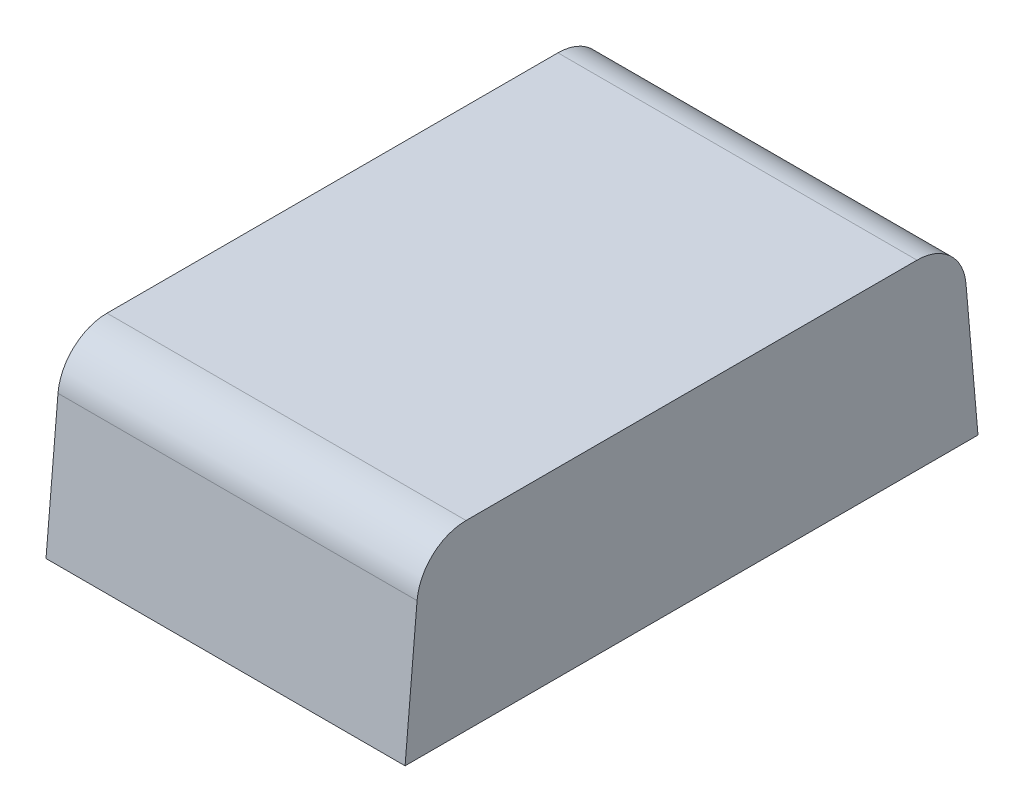
ISO-10303-21;
HEADER;
FILE_DESCRIPTION(('STEP AP214'),'2;1');
FILE_NAME('part.step','',(''),(''),'','','');
FILE_SCHEMA(('AUTOMOTIVE_DESIGN { 1 0 10303 214 1 1 1 1 }'));
ENDSEC;
DATA;
#1=APPLICATION_CONTEXT('core data for automotive mechanical design processes');
#2=APPLICATION_PROTOCOL_DEFINITION('international standard','automotive_design',2000,#1);
#3=PRODUCT_CONTEXT('',#1,'mechanical');
#4=PRODUCT('Part','Part','',(#3));
#5=PRODUCT_RELATED_PRODUCT_CATEGORY('part','',(#4));
#6=PRODUCT_DEFINITION_FORMATION('','',#4);
#7=PRODUCT_DEFINITION_CONTEXT('part definition',#1,'design');
#8=PRODUCT_DEFINITION('design','',#6,#7);
#9=PRODUCT_DEFINITION_SHAPE('','',#8);
#10=(LENGTH_UNIT() NAMED_UNIT(*) SI_UNIT(.MILLI.,.METRE.));
#11=(NAMED_UNIT(*) PLANE_ANGLE_UNIT() SI_UNIT($,.RADIAN.));
#12=(NAMED_UNIT(*) SI_UNIT($,.STERADIAN.) SOLID_ANGLE_UNIT());
#13=UNCERTAINTY_MEASURE_WITH_UNIT(LENGTH_MEASURE(1.E-05),#10,'distance_accuracy_value','');
#14=(GEOMETRIC_REPRESENTATION_CONTEXT(3) GLOBAL_UNCERTAINTY_ASSIGNED_CONTEXT((#13)) GLOBAL_UNIT_ASSIGNED_CONTEXT((#10,
#11,#12)) REPRESENTATION_CONTEXT('',''));
#15=CARTESIAN_POINT('',(0.,0.,0.));
#16=DIRECTION('',(0.,0.,1.));
#17=DIRECTION('',(1.,0.,0.));
#18=AXIS2_PLACEMENT_3D('',#15,#16,#17);
#19=CARTESIAN_POINT('',(0.505,1.3,-31.0166331174));
#20=DIRECTION('',(1.,0.,0.));
#21=DIRECTION('',(0.,0.,-1.));
#22=AXIS2_PLACEMENT_3D('',#19,#20,#21);
#23=CYLINDRICAL_SURFACE('',#22,0.0999999999999998);
#24=CARTESIAN_POINT('',(0.505,1.3,-31.0166331174));
#25=DIRECTION('',(1.,0.,0.));
#26=DIRECTION('',(0.,0.,-1.));
#27=AXIS2_PLACEMENT_3D('',#24,#25,#26);
#28=CIRCLE('',#27,0.0999999999999998);
#29=CARTESIAN_POINT('',(0.505,1.30871557427365,-30.9170136475899));
#30=VERTEX_POINT('',#29);
#31=CARTESIAN_POINT('',(0.505,1.4,-31.0166331174));
#32=VERTEX_POINT('',#31);
#33=EDGE_CURVE('E21',#30,#32,#28,.F.);
#34=ORIENTED_EDGE('',*,*,#33,.F.);
#35=DIRECTION('',(-1.,0.,0.));
#36=VECTOR('',#35,1.);
#37=CARTESIAN_POINT('',(0.87,1.308715574275,-30.91701364759));
#38=LINE('',#37,#36);
#39=CARTESIAN_POINT('',(1.235,1.30871557427458,-30.9170136475934));
#40=VERTEX_POINT('',#39);
#41=EDGE_CURVE('E61',#40,#30,#38,.T.);
#42=ORIENTED_EDGE('',*,*,#41,.F.);
#43=CARTESIAN_POINT('',(1.235,1.3,-31.0166331174));
#44=DIRECTION('',(1.,0.,0.));
#45=DIRECTION('',(0.,0.,-1.));
#46=AXIS2_PLACEMENT_3D('',#43,#44,#45);
#47=CIRCLE('',#46,0.0999999999999998);
#48=CARTESIAN_POINT('',(1.235,1.4,-31.0166331174));
#49=VERTEX_POINT('',#48);
#50=EDGE_CURVE('E84',#49,#40,#47,.T.);
#51=ORIENTED_EDGE('',*,*,#50,.F.);
#52=DIRECTION('',(1.,0.,0.));
#53=VECTOR('',#52,1.);
#54=CARTESIAN_POINT('',(0.87,1.4,-31.0166331174));
#55=LINE('',#54,#53);
#56=EDGE_CURVE('E74',#32,#49,#55,.T.);
#57=ORIENTED_EDGE('',*,*,#56,.F.);
#58=EDGE_LOOP('',(#34,#42,#51,#57));
#59=FACE_BOUND('',#58,.T.);
#60=ADVANCED_FACE('F17',(#59),#23,.T.);
#61=CARTESIAN_POINT('',(1.235,1.3,-31.9333668826));
#62=DIRECTION('',(-1.,0.,0.));
#63=DIRECTION('',(0.,0.,1.));
#64=AXIS2_PLACEMENT_3D('',#61,#62,#63);
#65=CYLINDRICAL_SURFACE('',#64,0.0999999999999998);
#66=CARTESIAN_POINT('',(1.235,1.3,-31.9333668826));
#67=DIRECTION('',(-1.,0.,0.));
#68=DIRECTION('',(0.,0.,1.));
#69=AXIS2_PLACEMENT_3D('',#66,#67,#68);
#70=CIRCLE('',#69,0.0999999999999998);
#71=CARTESIAN_POINT('',(1.235,1.30871557427469,-32.0329863524061));
#72=VERTEX_POINT('',#71);
#73=CARTESIAN_POINT('',(1.235,1.4,-31.9333668826));
#74=VERTEX_POINT('',#73);
#75=EDGE_CURVE('E97',#72,#74,#70,.F.);
#76=ORIENTED_EDGE('',*,*,#75,.F.);
#77=DIRECTION('',(1.,0.,0.));
#78=VECTOR('',#77,1.);
#79=CARTESIAN_POINT('',(0.87,1.308715574275,-32.03298635241));
#80=LINE('',#79,#78);
#81=CARTESIAN_POINT('',(0.505,1.30871557427458,-32.0329863524065));
#82=VERTEX_POINT('',#81);
#83=EDGE_CURVE('E79',#82,#72,#80,.T.);
#84=ORIENTED_EDGE('',*,*,#83,.F.);
#85=CARTESIAN_POINT('',(0.505,1.3,-31.9333668826));
#86=DIRECTION('',(-1.,0.,0.));
#87=DIRECTION('',(0.,0.,1.));
#88=AXIS2_PLACEMENT_3D('',#85,#86,#87);
#89=CIRCLE('',#88,0.0999999999999998);
#90=CARTESIAN_POINT('',(0.505,1.4,-31.9333668826));
#91=VERTEX_POINT('',#90);
#92=EDGE_CURVE('E105',#91,#82,#89,.T.);
#93=ORIENTED_EDGE('',*,*,#92,.F.);
#94=DIRECTION('',(-1.,0.,0.));
#95=VECTOR('',#94,1.);
#96=CARTESIAN_POINT('',(0.87,1.4,-31.9333668826));
#97=LINE('',#96,#95);
#98=EDGE_CURVE('E111',#74,#91,#97,.T.);
#99=ORIENTED_EDGE('',*,*,#98,.F.);
#100=EDGE_LOOP('',(#76,#84,#93,#99));
#101=FACE_BOUND('',#100,.T.);
#102=ADVANCED_FACE('F130',(#101),#65,.T.);
#103=CARTESIAN_POINT('',(1.235,1.4,-31.9333668826));
#104=DIRECTION('',(0.,1.,0.));
#105=DIRECTION('',(-1.,0.,0.));
#106=AXIS2_PLACEMENT_3D('',#103,#104,#105);
#107=PLANE('',#106);
#108=ORIENTED_EDGE('',*,*,#98,.T.);
#109=DIRECTION('',(0.,0.,-1.));
#110=VECTOR('',#109,1.);
#111=CARTESIAN_POINT('',(0.505,1.4,-31.475));
#112=LINE('',#111,#110);
#113=EDGE_CURVE('E78',#32,#91,#112,.T.);
#114=ORIENTED_EDGE('',*,*,#113,.F.);
#115=ORIENTED_EDGE('',*,*,#56,.T.);
#116=DIRECTION('',(0.,0.,1.));
#117=VECTOR('',#116,1.);
#118=CARTESIAN_POINT('',(1.235,1.4,-31.475));
#119=LINE('',#118,#117);
#120=EDGE_CURVE('E100',#74,#49,#119,.T.);
#121=ORIENTED_EDGE('',*,*,#120,.F.);
#122=EDGE_LOOP('',(#108,#114,#115,#121));
#123=FACE_BOUND('',#122,.T.);
#124=ADVANCED_FACE('F133',(#123),#107,.T.);
#125=CARTESIAN_POINT('',(1.235,1.03,-32.0573708055));
#126=DIRECTION('',(0.,0.0871557427222329,-0.99619469809397));
#127=DIRECTION('',(-1.,0.,0.));
#128=AXIS2_PLACEMENT_3D('',#125,#126,#127);
#129=PLANE('',#128);
#130=DIRECTION('',(-1.,0.,0.));
#131=VECTOR('',#130,1.);
#132=CARTESIAN_POINT('',(0.87,1.03,-32.0573708055));
#133=LINE('',#132,#131);
#134=CARTESIAN_POINT('',(1.235,1.03,-32.0573708055));
#135=VERTEX_POINT('',#134);
#136=CARTESIAN_POINT('',(0.505,1.03,-32.0573708055));
#137=VERTEX_POINT('',#136);
#138=EDGE_CURVE('E94',#135,#137,#133,.T.);
#139=ORIENTED_EDGE('',*,*,#138,.T.);
#140=DIRECTION('',(0.,-0.996194698091809,-0.0871557427469325));
#141=VECTOR('',#140,1.);
#142=CARTESIAN_POINT('',(0.505,1.3087155742748,-32.0329863524031));
#143=LINE('',#142,#141);
#144=EDGE_CURVE('E70',#82,#137,#143,.T.);
#145=ORIENTED_EDGE('',*,*,#144,.F.);
#146=ORIENTED_EDGE('',*,*,#83,.T.);
#147=DIRECTION('',(0.,0.996194698091546,0.0871557427499353));
#148=VECTOR('',#147,1.);
#149=CARTESIAN_POINT('',(1.235,1.03,-32.0573708055));
#150=LINE('',#149,#148);
#151=EDGE_CURVE('E101',#135,#72,#150,.T.);
#152=ORIENTED_EDGE('',*,*,#151,.F.);
#153=EDGE_LOOP('',(#139,#145,#146,#152));
#154=FACE_BOUND('',#153,.T.);
#155=ADVANCED_FACE('F128',(#154),#129,.T.);
#156=CARTESIAN_POINT('',(0.505,1.03,-32.0573708055));
#157=DIRECTION('',(-1.,0.,0.));
#158=DIRECTION('',(0.,0.,1.));
#159=AXIS2_PLACEMENT_3D('',#156,#157,#158);
#160=PLANE('',#159);
#161=DIRECTION('',(0.,0.,1.));
#162=VECTOR('',#161,1.);
#163=CARTESIAN_POINT('',(0.505,1.03,-31.475));
#164=LINE('',#163,#162);
#165=CARTESIAN_POINT('',(0.505,1.03,-30.8926291945));
#166=VERTEX_POINT('',#165);
#167=EDGE_CURVE('E83',#137,#166,#164,.T.);
#168=ORIENTED_EDGE('',*,*,#167,.T.);
#169=DIRECTION('',(0.,-0.996194698093973,0.087155742722196));
#170=VECTOR('',#169,1.);
#171=CARTESIAN_POINT('',(0.505,1.1693577871375,-30.904821421045));
#172=LINE('',#171,#170);
#173=EDGE_CURVE('E66',#30,#166,#172,.T.);
#174=ORIENTED_EDGE('',*,*,#173,.F.);
#175=ORIENTED_EDGE('',*,*,#33,.T.);
#176=ORIENTED_EDGE('',*,*,#113,.T.);
#177=ORIENTED_EDGE('',*,*,#92,.T.);
#178=ORIENTED_EDGE('',*,*,#144,.T.);
#179=EDGE_LOOP('',(#168,#174,#175,#176,#177,#178));
#180=FACE_BOUND('',#179,.T.);
#181=ADVANCED_FACE('F81',(#180),#160,.T.);
#182=CARTESIAN_POINT('',(0.505,1.03,-30.8926291945));
#183=DIRECTION('',(0.,0.087155742722196,0.996194698093973));
#184=DIRECTION('',(1.,0.,0.));
#185=AXIS2_PLACEMENT_3D('',#182,#183,#184);
#186=PLANE('',#185);
#187=DIRECTION('',(1.,0.,0.));
#188=VECTOR('',#187,1.);
#189=CARTESIAN_POINT('',(0.87,1.03,-30.8926291945));
#190=LINE('',#189,#188);
#191=CARTESIAN_POINT('',(1.235,1.03,-30.8926291945));
#192=VERTEX_POINT('',#191);
#193=EDGE_CURVE('E27',#166,#192,#190,.T.);
#194=ORIENTED_EDGE('',*,*,#193,.T.);
#195=DIRECTION('',(0.,-0.996194698091809,0.0871557427469325));
#196=VECTOR('',#195,1.);
#197=CARTESIAN_POINT('',(1.235,1.3087155742748,-30.917013647597));
#198=LINE('',#197,#196);
#199=EDGE_CURVE('E35',#40,#192,#198,.T.);
#200=ORIENTED_EDGE('',*,*,#199,.F.);
#201=ORIENTED_EDGE('',*,*,#41,.T.);
#202=ORIENTED_EDGE('',*,*,#173,.T.);
#203=EDGE_LOOP('',(#194,#200,#201,#202));
#204=FACE_BOUND('',#203,.T.);
#205=ADVANCED_FACE('F64',(#204),#186,.T.);
#206=CARTESIAN_POINT('',(1.235,1.03,-30.8926291945));
#207=DIRECTION('',(1.,0.,0.));
#208=DIRECTION('',(0.,0.,-1.));
#209=AXIS2_PLACEMENT_3D('',#206,#207,#208);
#210=PLANE('',#209);
#211=ORIENTED_EDGE('',*,*,#75,.T.);
#212=ORIENTED_EDGE('',*,*,#120,.T.);
#213=ORIENTED_EDGE('',*,*,#50,.T.);
#214=ORIENTED_EDGE('',*,*,#199,.T.);
#215=DIRECTION('',(0.,0.,-1.));
#216=VECTOR('',#215,1.);
#217=CARTESIAN_POINT('',(1.235,1.03,-31.475));
#218=LINE('',#217,#216);
#219=EDGE_CURVE('E11',#192,#135,#218,.T.);
#220=ORIENTED_EDGE('',*,*,#219,.T.);
#221=ORIENTED_EDGE('',*,*,#151,.T.);
#222=EDGE_LOOP('',(#211,#212,#213,#214,#220,#221));
#223=FACE_BOUND('',#222,.T.);
#224=ADVANCED_FACE('F120',(#223),#210,.T.);
#225=CARTESIAN_POINT('',(1.235,1.03,-32.0573708055));
#226=DIRECTION('',(0.,1.,0.));
#227=DIRECTION('',(-1.,0.,0.));
#228=AXIS2_PLACEMENT_3D('',#225,#226,#227);
#229=PLANE('',#228);
#230=ORIENTED_EDGE('',*,*,#193,.F.);
#231=ORIENTED_EDGE('',*,*,#167,.F.);
#232=ORIENTED_EDGE('',*,*,#138,.F.);
#233=ORIENTED_EDGE('',*,*,#219,.F.);
#234=EDGE_LOOP('',(#230,#231,#232,#233));
#235=FACE_BOUND('',#234,.T.);
#236=ADVANCED_FACE('F19',(#235),#229,.F.);
#237=CLOSED_SHELL('',(#60,#102,#124,#155,#181,#205,#224,#236));
#238=MANIFOLD_SOLID_BREP('B1',#237);
#239=ADVANCED_BREP_SHAPE_REPRESENTATION('',(#18,#238),#14);
#240=SHAPE_DEFINITION_REPRESENTATION(#9,#239);
ENDSEC;
END-ISO-10303-21;
